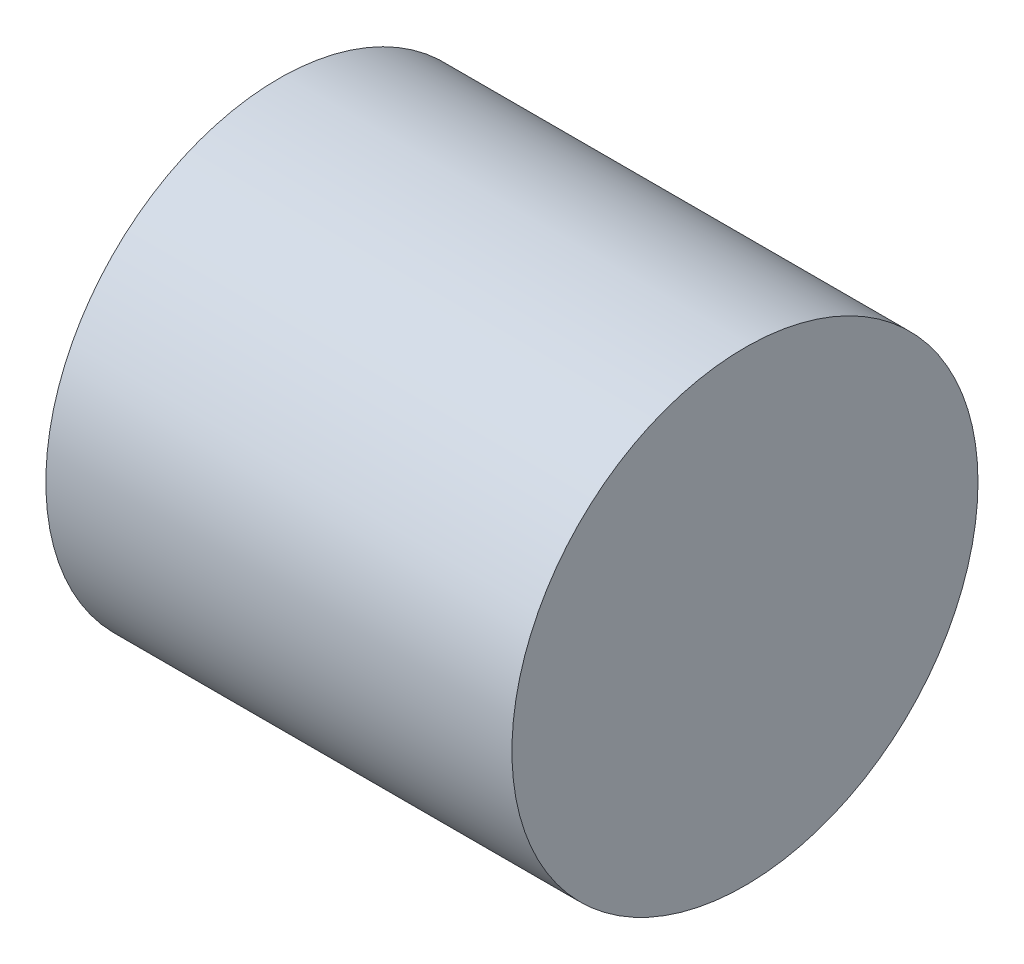
ISO-10303-21;
HEADER;
FILE_DESCRIPTION(('STEP AP214'),'2;1');
FILE_NAME('part.step','',(''),(''),'','','');
FILE_SCHEMA(('AUTOMOTIVE_DESIGN { 1 0 10303 214 1 1 1 1 }'));
ENDSEC;
DATA;
#1=APPLICATION_CONTEXT('core data for automotive mechanical design processes');
#2=APPLICATION_PROTOCOL_DEFINITION('international standard','automotive_design',2000,#1);
#3=PRODUCT_CONTEXT('',#1,'mechanical');
#4=PRODUCT('Part','Part','',(#3));
#5=PRODUCT_RELATED_PRODUCT_CATEGORY('part','',(#4));
#6=PRODUCT_DEFINITION_FORMATION('','',#4);
#7=PRODUCT_DEFINITION_CONTEXT('part definition',#1,'design');
#8=PRODUCT_DEFINITION('design','',#6,#7);
#9=PRODUCT_DEFINITION_SHAPE('','',#8);
#10=(LENGTH_UNIT() NAMED_UNIT(*) SI_UNIT(.MILLI.,.METRE.));
#11=(NAMED_UNIT(*) PLANE_ANGLE_UNIT() SI_UNIT($,.RADIAN.));
#12=(NAMED_UNIT(*) SI_UNIT($,.STERADIAN.) SOLID_ANGLE_UNIT());
#13=UNCERTAINTY_MEASURE_WITH_UNIT(LENGTH_MEASURE(1.E-05),#10,'distance_accuracy_value','');
#14=(GEOMETRIC_REPRESENTATION_CONTEXT(3) GLOBAL_UNCERTAINTY_ASSIGNED_CONTEXT((#13)) GLOBAL_UNIT_ASSIGNED_CONTEXT((#10,
#11,#12)) REPRESENTATION_CONTEXT('',''));
#15=CARTESIAN_POINT('',(0.,0.,0.));
#16=DIRECTION('',(0.,0.,1.));
#17=DIRECTION('',(1.,0.,0.));
#18=AXIS2_PLACEMENT_3D('',#15,#16,#17);
#19=CARTESIAN_POINT('',(1.27,0.,0.));
#20=DIRECTION('',(-1.,0.,0.));
#21=DIRECTION('',(0.,0.,1.));
#22=AXIS2_PLACEMENT_3D('',#19,#20,#21);
#23=CYLINDRICAL_SURFACE('',#22,0.635);
#24=CARTESIAN_POINT('',(1.27,0.,0.));
#25=DIRECTION('',(1.,0.,0.));
#26=DIRECTION('',(0.,0.,-1.));
#27=AXIS2_PLACEMENT_3D('',#24,#25,#26);
#28=CIRCLE('',#27,0.635);
#29=CARTESIAN_POINT('',(1.27,0.,-0.635));
#30=VERTEX_POINT('',#29);
#31=EDGE_CURVE('E10',#30,#30,#28,.T.);
#32=ORIENTED_EDGE('',*,*,#31,.F.);
#33=EDGE_LOOP('',(#32));
#34=FACE_BOUND('',#33,.T.);
#35=CARTESIAN_POINT('',(0.,0.,0.));
#36=DIRECTION('',(1.,0.,0.));
#37=DIRECTION('',(0.,0.,-1.));
#38=AXIS2_PLACEMENT_3D('',#35,#36,#37);
#39=CIRCLE('',#38,0.635);
#40=CARTESIAN_POINT('',(0.,0.,-0.635));
#41=VERTEX_POINT('',#40);
#42=EDGE_CURVE('E44',#41,#41,#39,.T.);
#43=ORIENTED_EDGE('',*,*,#42,.T.);
#44=EDGE_LOOP('',(#43));
#45=FACE_BOUND('',#44,.T.);
#46=ADVANCED_FACE('F41',(#34,#45),#23,.T.);
#47=CARTESIAN_POINT('',(1.27,0.,0.));
#48=DIRECTION('',(1.,0.,0.));
#49=DIRECTION('',(0.,0.,-1.));
#50=AXIS2_PLACEMENT_3D('',#47,#48,#49);
#51=PLANE('',#50);
#52=ORIENTED_EDGE('',*,*,#31,.T.);
#53=EDGE_LOOP('',(#52));
#54=FACE_BOUND('',#53,.T.);
#55=ADVANCED_FACE('F58',(#54),#51,.T.);
#56=CARTESIAN_POINT('',(0.,0.,0.));
#57=DIRECTION('',(1.,0.,0.));
#58=DIRECTION('',(0.,0.,-1.));
#59=AXIS2_PLACEMENT_3D('',#56,#57,#58);
#60=PLANE('',#59);
#61=ORIENTED_EDGE('',*,*,#42,.F.);
#62=EDGE_LOOP('',(#61));
#63=FACE_BOUND('',#62,.T.);
#64=ADVANCED_FACE('F56',(#63),#60,.F.);
#65=CLOSED_SHELL('',(#46,#55,#64));
#66=MANIFOLD_SOLID_BREP('B2',#65);
#67=ADVANCED_BREP_SHAPE_REPRESENTATION('',(#18,#66),#14);
#68=SHAPE_DEFINITION_REPRESENTATION(#9,#67);
ENDSEC;
END-ISO-10303-21;
